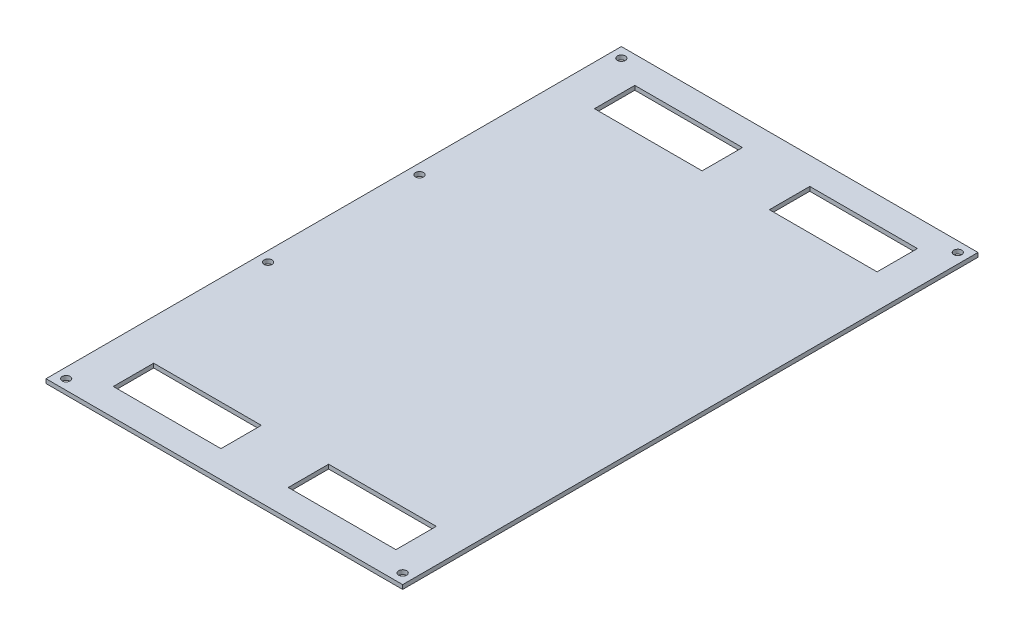
ISO-10303-21;
HEADER;
FILE_DESCRIPTION(('STEP AP214'),'2;1');
FILE_NAME('part.step','',(''),(''),'','','');
FILE_SCHEMA(('AUTOMOTIVE_DESIGN { 1 0 10303 214 1 1 1 1 }'));
ENDSEC;
DATA;
#1=APPLICATION_CONTEXT('core data for automotive mechanical design processes');
#2=APPLICATION_PROTOCOL_DEFINITION('international standard','automotive_design',2000,#1);
#3=PRODUCT_CONTEXT('',#1,'mechanical');
#4=PRODUCT('Part','Part','',(#3));
#5=PRODUCT_RELATED_PRODUCT_CATEGORY('part','',(#4));
#6=PRODUCT_DEFINITION_FORMATION('','',#4);
#7=PRODUCT_DEFINITION_CONTEXT('part definition',#1,'design');
#8=PRODUCT_DEFINITION('design','',#6,#7);
#9=PRODUCT_DEFINITION_SHAPE('','',#8);
#10=(LENGTH_UNIT() NAMED_UNIT(*) SI_UNIT(.MILLI.,.METRE.));
#11=(NAMED_UNIT(*) PLANE_ANGLE_UNIT() SI_UNIT($,.RADIAN.));
#12=(NAMED_UNIT(*) SI_UNIT($,.STERADIAN.) SOLID_ANGLE_UNIT());
#13=UNCERTAINTY_MEASURE_WITH_UNIT(LENGTH_MEASURE(1.E-05),#10,'distance_accuracy_value','');
#14=(GEOMETRIC_REPRESENTATION_CONTEXT(3) GLOBAL_UNCERTAINTY_ASSIGNED_CONTEXT((#13)) GLOBAL_UNIT_ASSIGNED_CONTEXT((#10,
#11,#12)) REPRESENTATION_CONTEXT('',''));
#15=CARTESIAN_POINT('',(0.,0.,0.));
#16=DIRECTION('',(0.,0.,1.));
#17=DIRECTION('',(1.,0.,0.));
#18=AXIS2_PLACEMENT_3D('',#15,#16,#17);
#19=CARTESIAN_POINT('',(0.,-1.5875,0.));
#20=DIRECTION('',(-1.,0.,0.));
#21=DIRECTION('',(0.,0.,1.));
#22=AXIS2_PLACEMENT_3D('',#19,#20,#21);
#23=PLANE('',#22);
#24=DIRECTION('',(0.,0.,1.));
#25=VECTOR('',#24,1.);
#26=CARTESIAN_POINT('',(0.,0.,0.));
#27=LINE('',#26,#25);
#28=CARTESIAN_POINT('',(0.,0.,-217.17));
#29=VERTEX_POINT('',#28);
#30=CARTESIAN_POINT('',(0.,0.,0.));
#31=VERTEX_POINT('',#30);
#32=EDGE_CURVE('E256',#29,#31,#27,.T.);
#33=ORIENTED_EDGE('',*,*,#32,.F.);
#34=DIRECTION('',(0.,1.,0.));
#35=VECTOR('',#34,1.);
#36=CARTESIAN_POINT('',(0.,-1.5875,-217.17));
#37=LINE('',#36,#35);
#38=CARTESIAN_POINT('',(0.,-1.5875,-217.17));
#39=VERTEX_POINT('',#38);
#40=EDGE_CURVE('E287',#39,#29,#37,.T.);
#41=ORIENTED_EDGE('',*,*,#40,.F.);
#42=DIRECTION('',(0.,0.,1.));
#43=VECTOR('',#42,1.);
#44=CARTESIAN_POINT('',(0.,-1.5875,0.));
#45=LINE('',#44,#43);
#46=CARTESIAN_POINT('',(0.,-1.5875,0.));
#47=VERTEX_POINT('',#46);
#48=EDGE_CURVE('E263',#39,#47,#45,.T.);
#49=ORIENTED_EDGE('',*,*,#48,.T.);
#50=DIRECTION('',(0.,1.,0.));
#51=VECTOR('',#50,1.);
#52=CARTESIAN_POINT('',(0.,-1.5875,0.));
#53=LINE('',#52,#51);
#54=EDGE_CURVE('E276',#47,#31,#53,.T.);
#55=ORIENTED_EDGE('',*,*,#54,.T.);
#56=EDGE_LOOP('',(#33,#41,#49,#55));
#57=FACE_BOUND('',#56,.T.);
#58=ADVANCED_FACE('F36',(#57),#23,.T.);
#59=CARTESIAN_POINT('',(0.,-1.5875,-217.17));
#60=DIRECTION('',(0.,0.,-1.));
#61=DIRECTION('',(-1.,0.,0.));
#62=AXIS2_PLACEMENT_3D('',#59,#60,#61);
#63=PLANE('',#62);
#64=DIRECTION('',(-1.,0.,0.));
#65=VECTOR('',#64,1.);
#66=CARTESIAN_POINT('',(0.,0.,-217.17));
#67=LINE('',#66,#65);
#68=CARTESIAN_POINT('',(134.62,0.,-217.17));
#69=VERTEX_POINT('',#68);
#70=EDGE_CURVE('E267',#69,#29,#67,.T.);
#71=ORIENTED_EDGE('',*,*,#70,.F.);
#72=DIRECTION('',(0.,1.,0.));
#73=VECTOR('',#72,1.);
#74=CARTESIAN_POINT('',(134.62,-1.5875,-217.17));
#75=LINE('',#74,#73);
#76=CARTESIAN_POINT('',(134.62,-1.5875,-217.17));
#77=VERTEX_POINT('',#76);
#78=EDGE_CURVE('E290',#77,#69,#75,.T.);
#79=ORIENTED_EDGE('',*,*,#78,.F.);
#80=DIRECTION('',(-1.,0.,0.));
#81=VECTOR('',#80,1.);
#82=CARTESIAN_POINT('',(0.,-1.5875,-217.17));
#83=LINE('',#82,#81);
#84=EDGE_CURVE('E273',#77,#39,#83,.T.);
#85=ORIENTED_EDGE('',*,*,#84,.T.);
#86=ORIENTED_EDGE('',*,*,#40,.T.);
#87=EDGE_LOOP('',(#71,#79,#85,#86));
#88=FACE_BOUND('',#87,.T.);
#89=ADVANCED_FACE('F385',(#88),#63,.T.);
#90=CARTESIAN_POINT('',(134.62,-1.5875,0.));
#91=DIRECTION('',(1.,0.,0.));
#92=DIRECTION('',(0.,0.,-1.));
#93=AXIS2_PLACEMENT_3D('',#90,#91,#92);
#94=PLANE('',#93);
#95=DIRECTION('',(0.,0.,-1.));
#96=VECTOR('',#95,1.);
#97=CARTESIAN_POINT('',(134.62,0.,0.));
#98=LINE('',#97,#96);
#99=CARTESIAN_POINT('',(134.62,0.,0.));
#100=VERTEX_POINT('',#99);
#101=EDGE_CURVE('E282',#100,#69,#98,.T.);
#102=ORIENTED_EDGE('',*,*,#101,.F.);
#103=DIRECTION('',(0.,1.,0.));
#104=VECTOR('',#103,1.);
#105=CARTESIAN_POINT('',(134.62,-1.5875,0.));
#106=LINE('',#105,#104);
#107=CARTESIAN_POINT('',(134.62,-1.5875,0.));
#108=VERTEX_POINT('',#107);
#109=EDGE_CURVE('E292',#108,#100,#106,.T.);
#110=ORIENTED_EDGE('',*,*,#109,.F.);
#111=DIRECTION('',(0.,0.,-1.));
#112=VECTOR('',#111,1.);
#113=CARTESIAN_POINT('',(134.62,-1.5875,0.));
#114=LINE('',#113,#112);
#115=EDGE_CURVE('E270',#108,#77,#114,.T.);
#116=ORIENTED_EDGE('',*,*,#115,.T.);
#117=ORIENTED_EDGE('',*,*,#78,.T.);
#118=EDGE_LOOP('',(#102,#110,#116,#117));
#119=FACE_BOUND('',#118,.T.);
#120=ADVANCED_FACE('F390',(#119),#94,.T.);
#121=CARTESIAN_POINT('',(0.,-1.5875,0.));
#122=DIRECTION('',(0.,0.,1.));
#123=DIRECTION('',(1.,0.,0.));
#124=AXIS2_PLACEMENT_3D('',#121,#122,#123);
#125=PLANE('',#124);
#126=DIRECTION('',(1.,0.,0.));
#127=VECTOR('',#126,1.);
#128=CARTESIAN_POINT('',(0.,0.,0.));
#129=LINE('',#128,#127);
#130=EDGE_CURVE('E279',#31,#100,#129,.T.);
#131=ORIENTED_EDGE('',*,*,#130,.F.);
#132=ORIENTED_EDGE('',*,*,#54,.F.);
#133=DIRECTION('',(1.,0.,0.));
#134=VECTOR('',#133,1.);
#135=CARTESIAN_POINT('',(0.,-1.5875,0.));
#136=LINE('',#135,#134);
#137=EDGE_CURVE('E266',#47,#108,#136,.T.);
#138=ORIENTED_EDGE('',*,*,#137,.T.);
#139=ORIENTED_EDGE('',*,*,#109,.T.);
#140=EDGE_LOOP('',(#131,#132,#138,#139));
#141=FACE_BOUND('',#140,.T.);
#142=ADVANCED_FACE('F404',(#141),#125,.T.);
#143=CARTESIAN_POINT('',(0.,-1.5875,0.));
#144=DIRECTION('',(0.,-1.,0.));
#145=DIRECTION('',(0.,0.,-1.));
#146=AXIS2_PLACEMENT_3D('',#143,#144,#145);
#147=PLANE('',#146);
#148=CARTESIAN_POINT('',(130.81,-1.5875,-213.36));
#149=DIRECTION('',(0.,-1.,0.));
#150=DIRECTION('',(0.,0.,-1.));
#151=AXIS2_PLACEMENT_3D('',#148,#149,#150);
#152=CIRCLE('',#151,1.5);
#153=CARTESIAN_POINT('',(130.81,-1.5875,-214.86));
#154=VERTEX_POINT('',#153);
#155=EDGE_CURVE('E738',#154,#154,#152,.T.);
#156=ORIENTED_EDGE('',*,*,#155,.F.);
#157=EDGE_LOOP('',(#156));
#158=FACE_BOUND('',#157,.T.);
#159=CARTESIAN_POINT('',(130.81,-1.5875,-3.81));
#160=DIRECTION('',(0.,-1.,0.));
#161=DIRECTION('',(0.,0.,-1.));
#162=AXIS2_PLACEMENT_3D('',#159,#160,#161);
#163=CIRCLE('',#162,1.5);
#164=CARTESIAN_POINT('',(130.81,-1.5875,-5.31));
#165=VERTEX_POINT('',#164);
#166=EDGE_CURVE('E351',#165,#165,#163,.T.);
#167=ORIENTED_EDGE('',*,*,#166,.F.);
#168=EDGE_LOOP('',(#167));
#169=FACE_BOUND('',#168,.T.);
#170=CARTESIAN_POINT('',(3.80999999999999,-1.5875,-213.36));
#171=DIRECTION('',(0.,-1.,0.));
#172=DIRECTION('',(0.,0.,-1.));
#173=AXIS2_PLACEMENT_3D('',#170,#171,#172);
#174=CIRCLE('',#173,1.49999999999999);
#175=CARTESIAN_POINT('',(3.80999999999999,-1.5875,-214.86));
#176=VERTEX_POINT('',#175);
#177=EDGE_CURVE('E341',#176,#176,#174,.T.);
#178=ORIENTED_EDGE('',*,*,#177,.F.);
#179=EDGE_LOOP('',(#178));
#180=FACE_BOUND('',#179,.T.);
#181=CARTESIAN_POINT('',(3.81,-1.5875,-137.16));
#182=DIRECTION('',(0.,-1.,0.));
#183=DIRECTION('',(0.,0.,-1.));
#184=AXIS2_PLACEMENT_3D('',#181,#182,#183);
#185=CIRCLE('',#184,1.49999999999999);
#186=CARTESIAN_POINT('',(3.81,-1.5875,-138.66));
#187=VERTEX_POINT('',#186);
#188=EDGE_CURVE('E338',#187,#187,#185,.T.);
#189=ORIENTED_EDGE('',*,*,#188,.F.);
#190=EDGE_LOOP('',(#189));
#191=FACE_BOUND('',#190,.T.);
#192=CARTESIAN_POINT('',(3.81,-1.5875,-80.01));
#193=DIRECTION('',(0.,-1.,0.));
#194=DIRECTION('',(0.,0.,-1.));
#195=AXIS2_PLACEMENT_3D('',#192,#193,#194);
#196=CIRCLE('',#195,1.49999999999999);
#197=CARTESIAN_POINT('',(3.81,-1.5875,-81.51));
#198=VERTEX_POINT('',#197);
#199=EDGE_CURVE('E337',#198,#198,#196,.T.);
#200=ORIENTED_EDGE('',*,*,#199,.F.);
#201=EDGE_LOOP('',(#200));
#202=FACE_BOUND('',#201,.T.);
#203=CARTESIAN_POINT('',(3.81,-1.5875,-3.81));
#204=DIRECTION('',(0.,-1.,0.));
#205=DIRECTION('',(0.,0.,-1.));
#206=AXIS2_PLACEMENT_3D('',#203,#204,#205);
#207=CIRCLE('',#206,1.49999999999999);
#208=CARTESIAN_POINT('',(3.81,-1.5875,-5.30999999999999));
#209=VERTEX_POINT('',#208);
#210=EDGE_CURVE('E360',#209,#209,#207,.T.);
#211=ORIENTED_EDGE('',*,*,#210,.F.);
#212=EDGE_LOOP('',(#211));
#213=FACE_BOUND('',#212,.T.);
#214=DIRECTION('',(-1.,0.,0.));
#215=VECTOR('',#214,1.);
#216=CARTESIAN_POINT('',(55.88,-1.5875,-191.77));
#217=LINE('',#216,#215);
#218=CARTESIAN_POINT('',(55.88,-1.5875,-191.77));
#219=VERTEX_POINT('',#218);
#220=CARTESIAN_POINT('',(15.24,-1.5875,-191.77));
#221=VERTEX_POINT('',#220);
#222=EDGE_CURVE('E52',#219,#221,#217,.T.);
#223=ORIENTED_EDGE('',*,*,#222,.F.);
#224=DIRECTION('',(0.,0.,1.));
#225=VECTOR('',#224,1.);
#226=CARTESIAN_POINT('',(55.88,-1.5875,-191.77));
#227=LINE('',#226,#225);
#228=CARTESIAN_POINT('',(55.88,-1.5875,-207.01));
#229=VERTEX_POINT('',#228);
#230=EDGE_CURVE('E193',#229,#219,#227,.T.);
#231=ORIENTED_EDGE('',*,*,#230,.F.);
#232=DIRECTION('',(1.,0.,0.));
#233=VECTOR('',#232,1.);
#234=CARTESIAN_POINT('',(55.88,-1.5875,-207.01));
#235=LINE('',#234,#233);
#236=CARTESIAN_POINT('',(15.24,-1.5875,-207.01));
#237=VERTEX_POINT('',#236);
#238=EDGE_CURVE('E177',#237,#229,#235,.T.);
#239=ORIENTED_EDGE('',*,*,#238,.F.);
#240=DIRECTION('',(0.,0.,-1.));
#241=VECTOR('',#240,1.);
#242=CARTESIAN_POINT('',(15.24,-1.5875,-191.77));
#243=LINE('',#242,#241);
#244=EDGE_CURVE('E186',#221,#237,#243,.T.);
#245=ORIENTED_EDGE('',*,*,#244,.F.);
#246=EDGE_LOOP('',(#223,#231,#239,#245));
#247=FACE_BOUND('',#246,.T.);
#248=DIRECTION('',(-1.,0.,0.));
#249=VECTOR('',#248,1.);
#250=CARTESIAN_POINT('',(121.92,-1.5875,-191.77));
#251=LINE('',#250,#249);
#252=CARTESIAN_POINT('',(121.92,-1.5875,-191.77));
#253=VERTEX_POINT('',#252);
#254=CARTESIAN_POINT('',(81.28,-1.5875,-191.77));
#255=VERTEX_POINT('',#254);
#256=EDGE_CURVE('E200',#253,#255,#251,.T.);
#257=ORIENTED_EDGE('',*,*,#256,.F.);
#258=DIRECTION('',(0.,0.,1.));
#259=VECTOR('',#258,1.);
#260=CARTESIAN_POINT('',(121.92,-1.5875,-191.77));
#261=LINE('',#260,#259);
#262=CARTESIAN_POINT('',(121.92,-1.5875,-207.01));
#263=VERTEX_POINT('',#262);
#264=EDGE_CURVE('E210',#263,#253,#261,.T.);
#265=ORIENTED_EDGE('',*,*,#264,.F.);
#266=DIRECTION('',(1.,0.,0.));
#267=VECTOR('',#266,1.);
#268=CARTESIAN_POINT('',(121.92,-1.5875,-207.01));
#269=LINE('',#268,#267);
#270=CARTESIAN_POINT('',(81.28,-1.5875,-207.01));
#271=VERTEX_POINT('',#270);
#272=EDGE_CURVE('E207',#271,#263,#269,.T.);
#273=ORIENTED_EDGE('',*,*,#272,.F.);
#274=DIRECTION('',(0.,0.,-1.));
#275=VECTOR('',#274,1.);
#276=CARTESIAN_POINT('',(81.28,-1.5875,-191.77));
#277=LINE('',#276,#275);
#278=EDGE_CURVE('E204',#255,#271,#277,.T.);
#279=ORIENTED_EDGE('',*,*,#278,.F.);
#280=EDGE_LOOP('',(#257,#265,#273,#279));
#281=FACE_BOUND('',#280,.T.);
#282=DIRECTION('',(-1.,0.,0.));
#283=VECTOR('',#282,1.);
#284=CARTESIAN_POINT('',(55.88,-1.5875,-10.16));
#285=LINE('',#284,#283);
#286=CARTESIAN_POINT('',(55.88,-1.5875,-10.16));
#287=VERTEX_POINT('',#286);
#288=CARTESIAN_POINT('',(15.24,-1.5875,-10.16));
#289=VERTEX_POINT('',#288);
#290=EDGE_CURVE('E216',#287,#289,#285,.T.);
#291=ORIENTED_EDGE('',*,*,#290,.F.);
#292=DIRECTION('',(0.,0.,1.));
#293=VECTOR('',#292,1.);
#294=CARTESIAN_POINT('',(55.88,-1.5875,-10.16));
#295=LINE('',#294,#293);
#296=CARTESIAN_POINT('',(55.88,-1.5875,-25.4));
#297=VERTEX_POINT('',#296);
#298=EDGE_CURVE('E230',#297,#287,#295,.T.);
#299=ORIENTED_EDGE('',*,*,#298,.F.);
#300=DIRECTION('',(1.,0.,0.));
#301=VECTOR('',#300,1.);
#302=CARTESIAN_POINT('',(55.88,-1.5875,-25.4));
#303=LINE('',#302,#301);
#304=CARTESIAN_POINT('',(15.24,-1.5875,-25.4));
#305=VERTEX_POINT('',#304);
#306=EDGE_CURVE('E227',#305,#297,#303,.T.);
#307=ORIENTED_EDGE('',*,*,#306,.F.);
#308=DIRECTION('',(0.,0.,-1.));
#309=VECTOR('',#308,1.);
#310=CARTESIAN_POINT('',(15.24,-1.5875,-10.16));
#311=LINE('',#310,#309);
#312=EDGE_CURVE('E224',#289,#305,#311,.T.);
#313=ORIENTED_EDGE('',*,*,#312,.F.);
#314=EDGE_LOOP('',(#291,#299,#307,#313));
#315=FACE_BOUND('',#314,.T.);
#316=DIRECTION('',(-1.,0.,0.));
#317=VECTOR('',#316,1.);
#318=CARTESIAN_POINT('',(121.92,-1.5875,-10.16));
#319=LINE('',#318,#317);
#320=CARTESIAN_POINT('',(121.92,-1.5875,-10.16));
#321=VERTEX_POINT('',#320);
#322=CARTESIAN_POINT('',(81.28,-1.5875,-10.16));
#323=VERTEX_POINT('',#322);
#324=EDGE_CURVE('E236',#321,#323,#319,.T.);
#325=ORIENTED_EDGE('',*,*,#324,.F.);
#326=DIRECTION('',(0.,0.,1.));
#327=VECTOR('',#326,1.);
#328=CARTESIAN_POINT('',(121.92,-1.5875,-10.16));
#329=LINE('',#328,#327);
#330=CARTESIAN_POINT('',(121.92,-1.5875,-25.4));
#331=VERTEX_POINT('',#330);
#332=EDGE_CURVE('E250',#331,#321,#329,.T.);
#333=ORIENTED_EDGE('',*,*,#332,.F.);
#334=DIRECTION('',(1.,0.,0.));
#335=VECTOR('',#334,1.);
#336=CARTESIAN_POINT('',(121.92,-1.5875,-25.4));
#337=LINE('',#336,#335);
#338=CARTESIAN_POINT('',(81.28,-1.5875,-25.4));
#339=VERTEX_POINT('',#338);
#340=EDGE_CURVE('E247',#339,#331,#337,.T.);
#341=ORIENTED_EDGE('',*,*,#340,.F.);
#342=DIRECTION('',(0.,0.,-1.));
#343=VECTOR('',#342,1.);
#344=CARTESIAN_POINT('',(81.28,-1.5875,-10.16));
#345=LINE('',#344,#343);
#346=EDGE_CURVE('E244',#323,#339,#345,.T.);
#347=ORIENTED_EDGE('',*,*,#346,.F.);
#348=EDGE_LOOP('',(#325,#333,#341,#347));
#349=FACE_BOUND('',#348,.T.);
#350=ORIENTED_EDGE('',*,*,#48,.F.);
#351=ORIENTED_EDGE('',*,*,#84,.F.);
#352=ORIENTED_EDGE('',*,*,#115,.F.);
#353=ORIENTED_EDGE('',*,*,#137,.F.);
#354=EDGE_LOOP('',(#350,#351,#352,#353));
#355=FACE_BOUND('',#354,.T.);
#356=ADVANCED_FACE('F190',(#158,#169,#180,#191,#202,#213,#247,#281,#315,#349,#355),#147,.T.);
#357=CARTESIAN_POINT('',(0.,0.,0.));
#358=DIRECTION('',(0.,-1.,0.));
#359=DIRECTION('',(0.,0.,-1.));
#360=AXIS2_PLACEMENT_3D('',#357,#358,#359);
#361=PLANE('',#360);
#362=CARTESIAN_POINT('',(130.81,0.,-213.36));
#363=DIRECTION('',(0.,-1.,0.));
#364=DIRECTION('',(0.,0.,-1.));
#365=AXIS2_PLACEMENT_3D('',#362,#363,#364);
#366=CIRCLE('',#365,1.5);
#367=CARTESIAN_POINT('',(130.81,0.,-214.86));
#368=VERTEX_POINT('',#367);
#369=EDGE_CURVE('E741',#368,#368,#366,.T.);
#370=ORIENTED_EDGE('',*,*,#369,.T.);
#371=EDGE_LOOP('',(#370));
#372=FACE_BOUND('',#371,.T.);
#373=CARTESIAN_POINT('',(130.81,0.,-3.81));
#374=DIRECTION('',(0.,-1.,0.));
#375=DIRECTION('',(0.,0.,-1.));
#376=AXIS2_PLACEMENT_3D('',#373,#374,#375);
#377=CIRCLE('',#376,1.5);
#378=CARTESIAN_POINT('',(130.81,0.,-5.31));
#379=VERTEX_POINT('',#378);
#380=EDGE_CURVE('E39',#379,#379,#377,.T.);
#381=ORIENTED_EDGE('',*,*,#380,.T.);
#382=EDGE_LOOP('',(#381));
#383=FACE_BOUND('',#382,.T.);
#384=CARTESIAN_POINT('',(3.80999999999999,0.,-213.36));
#385=DIRECTION('',(0.,-1.,0.));
#386=DIRECTION('',(0.,0.,-1.));
#387=AXIS2_PLACEMENT_3D('',#384,#385,#386);
#388=CIRCLE('',#387,1.49999999999999);
#389=CARTESIAN_POINT('',(3.80999999999999,0.,-214.86));
#390=VERTEX_POINT('',#389);
#391=EDGE_CURVE('E339',#390,#390,#388,.T.);
#392=ORIENTED_EDGE('',*,*,#391,.T.);
#393=EDGE_LOOP('',(#392));
#394=FACE_BOUND('',#393,.T.);
#395=CARTESIAN_POINT('',(3.81,0.,-137.16));
#396=DIRECTION('',(0.,-1.,0.));
#397=DIRECTION('',(0.,0.,-1.));
#398=AXIS2_PLACEMENT_3D('',#395,#396,#397);
#399=CIRCLE('',#398,1.49999999999999);
#400=CARTESIAN_POINT('',(3.81,0.,-138.66));
#401=VERTEX_POINT('',#400);
#402=EDGE_CURVE('E335',#401,#401,#399,.T.);
#403=ORIENTED_EDGE('',*,*,#402,.T.);
#404=EDGE_LOOP('',(#403));
#405=FACE_BOUND('',#404,.T.);
#406=CARTESIAN_POINT('',(3.81,0.,-80.01));
#407=DIRECTION('',(0.,-1.,0.));
#408=DIRECTION('',(0.,0.,-1.));
#409=AXIS2_PLACEMENT_3D('',#406,#407,#408);
#410=CIRCLE('',#409,1.49999999999999);
#411=CARTESIAN_POINT('',(3.81,0.,-81.51));
#412=VERTEX_POINT('',#411);
#413=EDGE_CURVE('E357',#412,#412,#410,.T.);
#414=ORIENTED_EDGE('',*,*,#413,.T.);
#415=EDGE_LOOP('',(#414));
#416=FACE_BOUND('',#415,.T.);
#417=CARTESIAN_POINT('',(3.81,0.,-3.81));
#418=DIRECTION('',(0.,-1.,0.));
#419=DIRECTION('',(0.,0.,-1.));
#420=AXIS2_PLACEMENT_3D('',#417,#418,#419);
#421=CIRCLE('',#420,1.49999999999999);
#422=CARTESIAN_POINT('',(3.81,0.,-5.30999999999999));
#423=VERTEX_POINT('',#422);
#424=EDGE_CURVE('E363',#423,#423,#421,.T.);
#425=ORIENTED_EDGE('',*,*,#424,.T.);
#426=EDGE_LOOP('',(#425));
#427=FACE_BOUND('',#426,.T.);
#428=DIRECTION('',(0.,0.,1.));
#429=VECTOR('',#428,1.);
#430=CARTESIAN_POINT('',(55.88,0.,0.));
#431=LINE('',#430,#429);
#432=CARTESIAN_POINT('',(55.88,0.,-207.01));
#433=VERTEX_POINT('',#432);
#434=CARTESIAN_POINT('',(55.88,0.,-191.77));
#435=VERTEX_POINT('',#434);
#436=EDGE_CURVE('E44',#433,#435,#431,.T.);
#437=ORIENTED_EDGE('',*,*,#436,.T.);
#438=DIRECTION('',(-1.,0.,0.));
#439=VECTOR('',#438,1.);
#440=CARTESIAN_POINT('',(-1.30971622436249E-13,0.,-191.77));
#441=LINE('',#440,#439);
#442=CARTESIAN_POINT('',(15.24,0.,-191.77));
#443=VERTEX_POINT('',#442);
#444=EDGE_CURVE('E11',#435,#443,#441,.T.);
#445=ORIENTED_EDGE('',*,*,#444,.T.);
#446=DIRECTION('',(0.,0.,-1.));
#447=VECTOR('',#446,1.);
#448=CARTESIAN_POINT('',(15.24,0.,0.));
#449=LINE('',#448,#447);
#450=CARTESIAN_POINT('',(15.24,0.,-207.01));
#451=VERTEX_POINT('',#450);
#452=EDGE_CURVE('E330',#443,#451,#449,.T.);
#453=ORIENTED_EDGE('',*,*,#452,.T.);
#454=DIRECTION('',(1.,0.,0.));
#455=VECTOR('',#454,1.);
#456=CARTESIAN_POINT('',(0.,0.,-207.01));
#457=LINE('',#456,#455);
#458=EDGE_CURVE('E180',#451,#433,#457,.T.);
#459=ORIENTED_EDGE('',*,*,#458,.T.);
#460=EDGE_LOOP('',(#437,#445,#453,#459));
#461=FACE_BOUND('',#460,.T.);
#462=DIRECTION('',(0.,0.,1.));
#463=VECTOR('',#462,1.);
#464=CARTESIAN_POINT('',(121.92,0.,0.));
#465=LINE('',#464,#463);
#466=CARTESIAN_POINT('',(121.92,0.,-207.01));
#467=VERTEX_POINT('',#466);
#468=CARTESIAN_POINT('',(121.92,0.,-191.77));
#469=VERTEX_POINT('',#468);
#470=EDGE_CURVE('E324',#467,#469,#465,.T.);
#471=ORIENTED_EDGE('',*,*,#470,.T.);
#472=DIRECTION('',(-1.,0.,0.));
#473=VECTOR('',#472,1.);
#474=CARTESIAN_POINT('',(0.,0.,-191.77));
#475=LINE('',#474,#473);
#476=CARTESIAN_POINT('',(81.28,0.,-191.77));
#477=VERTEX_POINT('',#476);
#478=EDGE_CURVE('E327',#469,#477,#475,.T.);
#479=ORIENTED_EDGE('',*,*,#478,.T.);
#480=DIRECTION('',(0.,0.,-1.));
#481=VECTOR('',#480,1.);
#482=CARTESIAN_POINT('',(81.28,0.,0.));
#483=LINE('',#482,#481);
#484=CARTESIAN_POINT('',(81.28,0.,-207.01));
#485=VERTEX_POINT('',#484);
#486=EDGE_CURVE('E318',#477,#485,#483,.T.);
#487=ORIENTED_EDGE('',*,*,#486,.T.);
#488=DIRECTION('',(1.,0.,0.));
#489=VECTOR('',#488,1.);
#490=CARTESIAN_POINT('',(0.,0.,-207.01));
#491=LINE('',#490,#489);
#492=EDGE_CURVE('E321',#485,#467,#491,.T.);
#493=ORIENTED_EDGE('',*,*,#492,.T.);
#494=EDGE_LOOP('',(#471,#479,#487,#493));
#495=FACE_BOUND('',#494,.T.);
#496=DIRECTION('',(0.,0.,1.));
#497=VECTOR('',#496,1.);
#498=CARTESIAN_POINT('',(55.88,0.,0.));
#499=LINE('',#498,#497);
#500=CARTESIAN_POINT('',(55.88,0.,-25.4));
#501=VERTEX_POINT('',#500);
#502=CARTESIAN_POINT('',(55.88,0.,-10.16));
#503=VERTEX_POINT('',#502);
#504=EDGE_CURVE('E312',#501,#503,#499,.T.);
#505=ORIENTED_EDGE('',*,*,#504,.T.);
#506=DIRECTION('',(-1.,0.,0.));
#507=VECTOR('',#506,1.);
#508=CARTESIAN_POINT('',(0.,0.,-10.16));
#509=LINE('',#508,#507);
#510=CARTESIAN_POINT('',(15.24,0.,-10.16));
#511=VERTEX_POINT('',#510);
#512=EDGE_CURVE('E315',#503,#511,#509,.T.);
#513=ORIENTED_EDGE('',*,*,#512,.T.);
#514=DIRECTION('',(0.,0.,-1.));
#515=VECTOR('',#514,1.);
#516=CARTESIAN_POINT('',(15.24,0.,0.));
#517=LINE('',#516,#515);
#518=CARTESIAN_POINT('',(15.24,0.,-25.4));
#519=VERTEX_POINT('',#518);
#520=EDGE_CURVE('E306',#511,#519,#517,.T.);
#521=ORIENTED_EDGE('',*,*,#520,.T.);
#522=DIRECTION('',(1.,0.,0.));
#523=VECTOR('',#522,1.);
#524=CARTESIAN_POINT('',(0.,0.,-25.4));
#525=LINE('',#524,#523);
#526=EDGE_CURVE('E309',#519,#501,#525,.T.);
#527=ORIENTED_EDGE('',*,*,#526,.T.);
#528=EDGE_LOOP('',(#505,#513,#521,#527));
#529=FACE_BOUND('',#528,.T.);
#530=DIRECTION('',(0.,0.,1.));
#531=VECTOR('',#530,1.);
#532=CARTESIAN_POINT('',(121.92,0.,1.11022302462516E-13));
#533=LINE('',#532,#531);
#534=CARTESIAN_POINT('',(121.92,0.,-25.4));
#535=VERTEX_POINT('',#534);
#536=CARTESIAN_POINT('',(121.92,0.,-10.16));
#537=VERTEX_POINT('',#536);
#538=EDGE_CURVE('E300',#535,#537,#533,.T.);
#539=ORIENTED_EDGE('',*,*,#538,.T.);
#540=DIRECTION('',(-1.,0.,0.));
#541=VECTOR('',#540,1.);
#542=CARTESIAN_POINT('',(0.,0.,-10.16));
#543=LINE('',#542,#541);
#544=CARTESIAN_POINT('',(81.28,0.,-10.16));
#545=VERTEX_POINT('',#544);
#546=EDGE_CURVE('E303',#537,#545,#543,.T.);
#547=ORIENTED_EDGE('',*,*,#546,.T.);
#548=DIRECTION('',(0.,0.,-1.));
#549=VECTOR('',#548,1.);
#550=CARTESIAN_POINT('',(81.28,0.,0.));
#551=LINE('',#550,#549);
#552=CARTESIAN_POINT('',(81.28,0.,-25.4));
#553=VERTEX_POINT('',#552);
#554=EDGE_CURVE('E289',#545,#553,#551,.T.);
#555=ORIENTED_EDGE('',*,*,#554,.T.);
#556=DIRECTION('',(1.,0.,0.));
#557=VECTOR('',#556,1.);
#558=CARTESIAN_POINT('',(0.,0.,-25.4));
#559=LINE('',#558,#557);
#560=EDGE_CURVE('E297',#553,#535,#559,.T.);
#561=ORIENTED_EDGE('',*,*,#560,.T.);
#562=EDGE_LOOP('',(#539,#547,#555,#561));
#563=FACE_BOUND('',#562,.T.);
#564=ORIENTED_EDGE('',*,*,#32,.T.);
#565=ORIENTED_EDGE('',*,*,#130,.T.);
#566=ORIENTED_EDGE('',*,*,#101,.T.);
#567=ORIENTED_EDGE('',*,*,#70,.T.);
#568=EDGE_LOOP('',(#564,#565,#566,#567));
#569=FACE_BOUND('',#568,.T.);
#570=ADVANCED_FACE('F367',(#372,#383,#394,#405,#416,#427,#461,#495,#529,#563,#569),#361,.F.);
#571=CARTESIAN_POINT('',(121.92,0.9525,-10.16));
#572=DIRECTION('',(0.,0.,1.));
#573=DIRECTION('',(1.,0.,0.));
#574=AXIS2_PLACEMENT_3D('',#571,#572,#573);
#575=PLANE('',#574);
#576=DIRECTION('',(0.,-1.,0.));
#577=VECTOR('',#576,1.);
#578=CARTESIAN_POINT('',(121.92,0.9525,-10.16));
#579=LINE('',#578,#577);
#580=EDGE_CURVE('E254',#537,#321,#579,.T.);
#581=ORIENTED_EDGE('',*,*,#580,.T.);
#582=ORIENTED_EDGE('',*,*,#324,.T.);
#583=DIRECTION('',(0.,-1.,0.));
#584=VECTOR('',#583,1.);
#585=CARTESIAN_POINT('',(81.28,0.9525,-10.16));
#586=LINE('',#585,#584);
#587=EDGE_CURVE('E253',#545,#323,#586,.T.);
#588=ORIENTED_EDGE('',*,*,#587,.F.);
#589=ORIENTED_EDGE('',*,*,#546,.F.);
#590=EDGE_LOOP('',(#581,#582,#588,#589));
#591=FACE_BOUND('',#590,.T.);
#592=ADVANCED_FACE('F414',(#591),#575,.F.);
#593=CARTESIAN_POINT('',(121.92,0.9525,-10.16));
#594=DIRECTION('',(1.,0.,0.));
#595=DIRECTION('',(0.,0.,-1.));
#596=AXIS2_PLACEMENT_3D('',#593,#594,#595);
#597=PLANE('',#596);
#598=DIRECTION('',(0.,-1.,0.));
#599=VECTOR('',#598,1.);
#600=CARTESIAN_POINT('',(121.92,0.9525,-25.4));
#601=LINE('',#600,#599);
#602=EDGE_CURVE('E257',#535,#331,#601,.T.);
#603=ORIENTED_EDGE('',*,*,#602,.T.);
#604=ORIENTED_EDGE('',*,*,#332,.T.);
#605=ORIENTED_EDGE('',*,*,#580,.F.);
#606=ORIENTED_EDGE('',*,*,#538,.F.);
#607=EDGE_LOOP('',(#603,#604,#605,#606));
#608=FACE_BOUND('',#607,.T.);
#609=ADVANCED_FACE('F421',(#608),#597,.F.);
#610=CARTESIAN_POINT('',(121.92,0.9525,-25.4));
#611=DIRECTION('',(0.,0.,-1.));
#612=DIRECTION('',(-1.,0.,0.));
#613=AXIS2_PLACEMENT_3D('',#610,#611,#612);
#614=PLANE('',#613);
#615=DIRECTION('',(0.,-1.,0.));
#616=VECTOR('',#615,1.);
#617=CARTESIAN_POINT('',(81.28,0.9525,-25.4));
#618=LINE('',#617,#616);
#619=EDGE_CURVE('E259',#553,#339,#618,.T.);
#620=ORIENTED_EDGE('',*,*,#619,.T.);
#621=ORIENTED_EDGE('',*,*,#340,.T.);
#622=ORIENTED_EDGE('',*,*,#602,.F.);
#623=ORIENTED_EDGE('',*,*,#560,.F.);
#624=EDGE_LOOP('',(#620,#621,#622,#623));
#625=FACE_BOUND('',#624,.T.);
#626=ADVANCED_FACE('F427',(#625),#614,.F.);
#627=CARTESIAN_POINT('',(81.28,0.9525,-10.16));
#628=DIRECTION('',(-1.,0.,0.));
#629=DIRECTION('',(0.,0.,1.));
#630=AXIS2_PLACEMENT_3D('',#627,#628,#629);
#631=PLANE('',#630);
#632=ORIENTED_EDGE('',*,*,#587,.T.);
#633=ORIENTED_EDGE('',*,*,#346,.T.);
#634=ORIENTED_EDGE('',*,*,#619,.F.);
#635=ORIENTED_EDGE('',*,*,#554,.F.);
#636=EDGE_LOOP('',(#632,#633,#634,#635));
#637=FACE_BOUND('',#636,.T.);
#638=ADVANCED_FACE('F423',(#637),#631,.F.);
#639=CARTESIAN_POINT('',(55.88,0.9525,-10.16));
#640=DIRECTION('',(0.,0.,1.));
#641=DIRECTION('',(1.,0.,0.));
#642=AXIS2_PLACEMENT_3D('',#639,#640,#641);
#643=PLANE('',#642);
#644=DIRECTION('',(0.,-1.,0.));
#645=VECTOR('',#644,1.);
#646=CARTESIAN_POINT('',(55.88,0.9525,-10.16));
#647=LINE('',#646,#645);
#648=EDGE_CURVE('E234',#503,#287,#647,.T.);
#649=ORIENTED_EDGE('',*,*,#648,.T.);
#650=ORIENTED_EDGE('',*,*,#290,.T.);
#651=DIRECTION('',(0.,-1.,0.));
#652=VECTOR('',#651,1.);
#653=CARTESIAN_POINT('',(15.24,0.9525,-10.16));
#654=LINE('',#653,#652);
#655=EDGE_CURVE('E233',#511,#289,#654,.T.);
#656=ORIENTED_EDGE('',*,*,#655,.F.);
#657=ORIENTED_EDGE('',*,*,#512,.F.);
#658=EDGE_LOOP('',(#649,#650,#656,#657));
#659=FACE_BOUND('',#658,.T.);
#660=ADVANCED_FACE('F426',(#659),#643,.F.);
#661=CARTESIAN_POINT('',(55.88,0.9525,-10.16));
#662=DIRECTION('',(1.,0.,0.));
#663=DIRECTION('',(0.,0.,-1.));
#664=AXIS2_PLACEMENT_3D('',#661,#662,#663);
#665=PLANE('',#664);
#666=DIRECTION('',(0.,-1.,0.));
#667=VECTOR('',#666,1.);
#668=CARTESIAN_POINT('',(55.88,0.9525,-25.4));
#669=LINE('',#668,#667);
#670=EDGE_CURVE('E237',#501,#297,#669,.T.);
#671=ORIENTED_EDGE('',*,*,#670,.T.);
#672=ORIENTED_EDGE('',*,*,#298,.T.);
#673=ORIENTED_EDGE('',*,*,#648,.F.);
#674=ORIENTED_EDGE('',*,*,#504,.F.);
#675=EDGE_LOOP('',(#671,#672,#673,#674));
#676=FACE_BOUND('',#675,.T.);
#677=ADVANCED_FACE('F437',(#676),#665,.F.);
#678=CARTESIAN_POINT('',(55.88,0.9525,-25.4));
#679=DIRECTION('',(0.,0.,-1.));
#680=DIRECTION('',(-1.,0.,0.));
#681=AXIS2_PLACEMENT_3D('',#678,#679,#680);
#682=PLANE('',#681);
#683=DIRECTION('',(0.,-1.,0.));
#684=VECTOR('',#683,1.);
#685=CARTESIAN_POINT('',(15.24,0.9525,-25.4));
#686=LINE('',#685,#684);
#687=EDGE_CURVE('E239',#519,#305,#686,.T.);
#688=ORIENTED_EDGE('',*,*,#687,.T.);
#689=ORIENTED_EDGE('',*,*,#306,.T.);
#690=ORIENTED_EDGE('',*,*,#670,.F.);
#691=ORIENTED_EDGE('',*,*,#526,.F.);
#692=EDGE_LOOP('',(#688,#689,#690,#691));
#693=FACE_BOUND('',#692,.T.);
#694=ADVANCED_FACE('F443',(#693),#682,.F.);
#695=CARTESIAN_POINT('',(15.24,0.9525,-10.16));
#696=DIRECTION('',(-1.,0.,0.));
#697=DIRECTION('',(0.,0.,1.));
#698=AXIS2_PLACEMENT_3D('',#695,#696,#697);
#699=PLANE('',#698);
#700=ORIENTED_EDGE('',*,*,#655,.T.);
#701=ORIENTED_EDGE('',*,*,#312,.T.);
#702=ORIENTED_EDGE('',*,*,#687,.F.);
#703=ORIENTED_EDGE('',*,*,#520,.F.);
#704=EDGE_LOOP('',(#700,#701,#702,#703));
#705=FACE_BOUND('',#704,.T.);
#706=ADVANCED_FACE('F439',(#705),#699,.F.);
#707=CARTESIAN_POINT('',(121.92,0.9525,-191.77));
#708=DIRECTION('',(0.,0.,1.));
#709=DIRECTION('',(1.,0.,0.));
#710=AXIS2_PLACEMENT_3D('',#707,#708,#709);
#711=PLANE('',#710);
#712=DIRECTION('',(0.,-1.,0.));
#713=VECTOR('',#712,1.);
#714=CARTESIAN_POINT('',(121.92,0.9525,-191.77));
#715=LINE('',#714,#713);
#716=EDGE_CURVE('E214',#469,#253,#715,.T.);
#717=ORIENTED_EDGE('',*,*,#716,.T.);
#718=ORIENTED_EDGE('',*,*,#256,.T.);
#719=DIRECTION('',(0.,-1.,0.));
#720=VECTOR('',#719,1.);
#721=CARTESIAN_POINT('',(81.28,0.9525,-191.77));
#722=LINE('',#721,#720);
#723=EDGE_CURVE('E213',#477,#255,#722,.T.);
#724=ORIENTED_EDGE('',*,*,#723,.F.);
#725=ORIENTED_EDGE('',*,*,#478,.F.);
#726=EDGE_LOOP('',(#717,#718,#724,#725));
#727=FACE_BOUND('',#726,.T.);
#728=ADVANCED_FACE('F442',(#727),#711,.F.);
#729=CARTESIAN_POINT('',(121.92,0.9525,-191.77));
#730=DIRECTION('',(1.,0.,0.));
#731=DIRECTION('',(0.,0.,-1.));
#732=AXIS2_PLACEMENT_3D('',#729,#730,#731);
#733=PLANE('',#732);
#734=DIRECTION('',(0.,-1.,0.));
#735=VECTOR('',#734,1.);
#736=CARTESIAN_POINT('',(121.92,0.9525,-207.01));
#737=LINE('',#736,#735);
#738=EDGE_CURVE('E217',#467,#263,#737,.T.);
#739=ORIENTED_EDGE('',*,*,#738,.T.);
#740=ORIENTED_EDGE('',*,*,#264,.T.);
#741=ORIENTED_EDGE('',*,*,#716,.F.);
#742=ORIENTED_EDGE('',*,*,#470,.F.);
#743=EDGE_LOOP('',(#739,#740,#741,#742));
#744=FACE_BOUND('',#743,.T.);
#745=ADVANCED_FACE('F453',(#744),#733,.F.);
#746=CARTESIAN_POINT('',(121.92,0.9525,-207.01));
#747=DIRECTION('',(0.,0.,-1.));
#748=DIRECTION('',(-1.,0.,0.));
#749=AXIS2_PLACEMENT_3D('',#746,#747,#748);
#750=PLANE('',#749);
#751=DIRECTION('',(0.,-1.,0.));
#752=VECTOR('',#751,1.);
#753=CARTESIAN_POINT('',(81.28,0.9525,-207.01));
#754=LINE('',#753,#752);
#755=EDGE_CURVE('E219',#485,#271,#754,.T.);
#756=ORIENTED_EDGE('',*,*,#755,.T.);
#757=ORIENTED_EDGE('',*,*,#272,.T.);
#758=ORIENTED_EDGE('',*,*,#738,.F.);
#759=ORIENTED_EDGE('',*,*,#492,.F.);
#760=EDGE_LOOP('',(#756,#757,#758,#759));
#761=FACE_BOUND('',#760,.T.);
#762=ADVANCED_FACE('F459',(#761),#750,.F.);
#763=CARTESIAN_POINT('',(81.28,0.9525,-191.77));
#764=DIRECTION('',(-1.,0.,0.));
#765=DIRECTION('',(0.,0.,1.));
#766=AXIS2_PLACEMENT_3D('',#763,#764,#765);
#767=PLANE('',#766);
#768=ORIENTED_EDGE('',*,*,#723,.T.);
#769=ORIENTED_EDGE('',*,*,#278,.T.);
#770=ORIENTED_EDGE('',*,*,#755,.F.);
#771=ORIENTED_EDGE('',*,*,#486,.F.);
#772=EDGE_LOOP('',(#768,#769,#770,#771));
#773=FACE_BOUND('',#772,.T.);
#774=ADVANCED_FACE('F455',(#773),#767,.F.);
#775=CARTESIAN_POINT('',(55.88,0.9525,-191.77));
#776=DIRECTION('',(0.,0.,1.));
#777=DIRECTION('',(1.,0.,0.));
#778=AXIS2_PLACEMENT_3D('',#775,#776,#777);
#779=PLANE('',#778);
#780=DIRECTION('',(0.,-1.,0.));
#781=VECTOR('',#780,1.);
#782=CARTESIAN_POINT('',(55.88,0.9525,-191.77));
#783=LINE('',#782,#781);
#784=EDGE_CURVE('E198',#435,#219,#783,.T.);
#785=ORIENTED_EDGE('',*,*,#784,.T.);
#786=ORIENTED_EDGE('',*,*,#222,.T.);
#787=DIRECTION('',(0.,-1.,0.));
#788=VECTOR('',#787,1.);
#789=CARTESIAN_POINT('',(15.24,0.9525,-191.77));
#790=LINE('',#789,#788);
#791=EDGE_CURVE('E183',#443,#221,#790,.T.);
#792=ORIENTED_EDGE('',*,*,#791,.F.);
#793=ORIENTED_EDGE('',*,*,#444,.F.);
#794=EDGE_LOOP('',(#785,#786,#792,#793));
#795=FACE_BOUND('',#794,.T.);
#796=ADVANCED_FACE('F458',(#795),#779,.F.);
#797=CARTESIAN_POINT('',(55.88,0.9525,-191.77));
#798=DIRECTION('',(1.,0.,0.));
#799=DIRECTION('',(0.,0.,-1.));
#800=AXIS2_PLACEMENT_3D('',#797,#798,#799);
#801=PLANE('',#800);
#802=DIRECTION('',(0.,-1.,0.));
#803=VECTOR('',#802,1.);
#804=CARTESIAN_POINT('',(55.88,0.9525,-207.01));
#805=LINE('',#804,#803);
#806=EDGE_CURVE('E182',#433,#229,#805,.T.);
#807=ORIENTED_EDGE('',*,*,#806,.T.);
#808=ORIENTED_EDGE('',*,*,#230,.T.);
#809=ORIENTED_EDGE('',*,*,#784,.F.);
#810=ORIENTED_EDGE('',*,*,#436,.F.);
#811=EDGE_LOOP('',(#807,#808,#809,#810));
#812=FACE_BOUND('',#811,.T.);
#813=ADVANCED_FACE('F468',(#812),#801,.F.);
#814=CARTESIAN_POINT('',(55.88,0.9525,-207.01));
#815=DIRECTION('',(0.,0.,-1.));
#816=DIRECTION('',(-1.,0.,0.));
#817=AXIS2_PLACEMENT_3D('',#814,#815,#816);
#818=PLANE('',#817);
#819=DIRECTION('',(0.,-1.,0.));
#820=VECTOR('',#819,1.);
#821=CARTESIAN_POINT('',(15.24,0.9525,-207.01));
#822=LINE('',#821,#820);
#823=EDGE_CURVE('E60',#451,#237,#822,.T.);
#824=ORIENTED_EDGE('',*,*,#823,.T.);
#825=ORIENTED_EDGE('',*,*,#238,.T.);
#826=ORIENTED_EDGE('',*,*,#806,.F.);
#827=ORIENTED_EDGE('',*,*,#458,.F.);
#828=EDGE_LOOP('',(#824,#825,#826,#827));
#829=FACE_BOUND('',#828,.T.);
#830=ADVANCED_FACE('F174',(#829),#818,.F.);
#831=CARTESIAN_POINT('',(15.24,0.9525,-191.77));
#832=DIRECTION('',(-1.,0.,0.));
#833=DIRECTION('',(0.,0.,1.));
#834=AXIS2_PLACEMENT_3D('',#831,#832,#833);
#835=PLANE('',#834);
#836=ORIENTED_EDGE('',*,*,#791,.T.);
#837=ORIENTED_EDGE('',*,*,#244,.T.);
#838=ORIENTED_EDGE('',*,*,#823,.F.);
#839=ORIENTED_EDGE('',*,*,#452,.F.);
#840=EDGE_LOOP('',(#836,#837,#838,#839));
#841=FACE_BOUND('',#840,.T.);
#842=ADVANCED_FACE('F187',(#841),#835,.F.);
#843=CARTESIAN_POINT('',(3.81,-1.5875,-3.81));
#844=DIRECTION('',(0.,-1.,0.));
#845=DIRECTION('',(0.,0.,-1.));
#846=AXIS2_PLACEMENT_3D('',#843,#844,#845);
#847=CYLINDRICAL_SURFACE('',#846,1.49999999999999);
#848=ORIENTED_EDGE('',*,*,#210,.T.);
#849=EDGE_LOOP('',(#848));
#850=FACE_BOUND('',#849,.T.);
#851=ORIENTED_EDGE('',*,*,#424,.F.);
#852=EDGE_LOOP('',(#851));
#853=FACE_BOUND('',#852,.T.);
#854=ADVANCED_FACE('F370',(#850,#853),#847,.F.);
#855=CARTESIAN_POINT('',(3.81,-1.5875,-80.01));
#856=DIRECTION('',(0.,-1.,0.));
#857=DIRECTION('',(0.,0.,-1.));
#858=AXIS2_PLACEMENT_3D('',#855,#856,#857);
#859=CYLINDRICAL_SURFACE('',#858,1.49999999999999);
#860=ORIENTED_EDGE('',*,*,#199,.T.);
#861=EDGE_LOOP('',(#860));
#862=FACE_BOUND('',#861,.T.);
#863=ORIENTED_EDGE('',*,*,#413,.F.);
#864=EDGE_LOOP('',(#863));
#865=FACE_BOUND('',#864,.T.);
#866=ADVANCED_FACE('F372',(#862,#865),#859,.F.);
#867=CARTESIAN_POINT('',(3.81,-1.5875,-137.16));
#868=DIRECTION('',(0.,-1.,0.));
#869=DIRECTION('',(0.,0.,-1.));
#870=AXIS2_PLACEMENT_3D('',#867,#868,#869);
#871=CYLINDRICAL_SURFACE('',#870,1.49999999999999);
#872=ORIENTED_EDGE('',*,*,#188,.T.);
#873=EDGE_LOOP('',(#872));
#874=FACE_BOUND('',#873,.T.);
#875=ORIENTED_EDGE('',*,*,#402,.F.);
#876=EDGE_LOOP('',(#875));
#877=FACE_BOUND('',#876,.T.);
#878=ADVANCED_FACE('F379',(#874,#877),#871,.F.);
#879=CARTESIAN_POINT('',(3.80999999999999,-1.5875,-213.36));
#880=DIRECTION('',(0.,-1.,0.));
#881=DIRECTION('',(0.,0.,-1.));
#882=AXIS2_PLACEMENT_3D('',#879,#880,#881);
#883=CYLINDRICAL_SURFACE('',#882,1.49999999999999);
#884=ORIENTED_EDGE('',*,*,#177,.T.);
#885=EDGE_LOOP('',(#884));
#886=FACE_BOUND('',#885,.T.);
#887=ORIENTED_EDGE('',*,*,#391,.F.);
#888=EDGE_LOOP('',(#887));
#889=FACE_BOUND('',#888,.T.);
#890=ADVANCED_FACE('F553',(#886,#889),#883,.F.);
#891=CARTESIAN_POINT('',(130.81,-1.5875,-3.81));
#892=DIRECTION('',(0.,-1.,0.));
#893=DIRECTION('',(0.,0.,-1.));
#894=AXIS2_PLACEMENT_3D('',#891,#892,#893);
#895=CYLINDRICAL_SURFACE('',#894,1.5);
#896=ORIENTED_EDGE('',*,*,#166,.T.);
#897=EDGE_LOOP('',(#896));
#898=FACE_BOUND('',#897,.T.);
#899=ORIENTED_EDGE('',*,*,#380,.F.);
#900=EDGE_LOOP('',(#899));
#901=FACE_BOUND('',#900,.T.);
#902=ADVANCED_FACE('F564',(#898,#901),#895,.F.);
#903=CARTESIAN_POINT('',(130.81,-1.5875,-213.36));
#904=DIRECTION('',(0.,-1.,0.));
#905=DIRECTION('',(0.,0.,-1.));
#906=AXIS2_PLACEMENT_3D('',#903,#904,#905);
#907=CYLINDRICAL_SURFACE('',#906,1.5);
#908=ORIENTED_EDGE('',*,*,#155,.T.);
#909=EDGE_LOOP('',(#908));
#910=FACE_BOUND('',#909,.T.);
#911=ORIENTED_EDGE('',*,*,#369,.F.);
#912=EDGE_LOOP('',(#911));
#913=FACE_BOUND('',#912,.T.);
#914=ADVANCED_FACE('F574',(#910,#913),#907,.F.);
#915=CLOSED_SHELL('',(#58,#89,#120,#142,#356,#570,#592,#609,#626,#638,#660,#677,#694,#706,#728,
#745,#762,#774,#796,#813,#830,#842,#854,#866,#878,#890,#902,#914));
#916=MANIFOLD_SOLID_BREP('B2',#915);
#917=ADVANCED_BREP_SHAPE_REPRESENTATION('',(#18,#916),#14);
#918=SHAPE_DEFINITION_REPRESENTATION(#9,#917);
ENDSEC;
END-ISO-10303-21;
